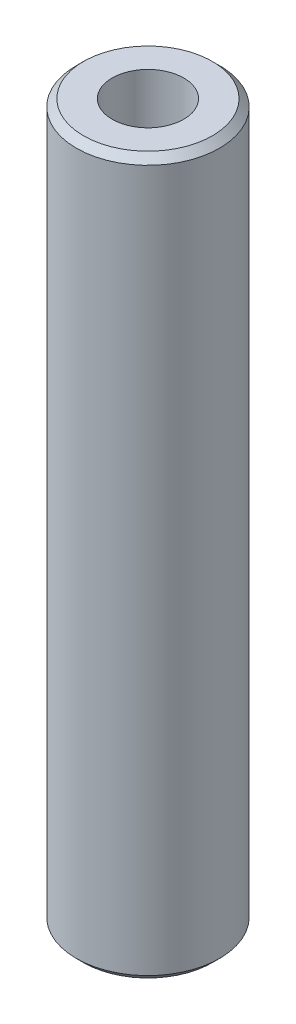
ISO-10303-21;
HEADER;
FILE_DESCRIPTION(('STEP AP214'),'2;1');
FILE_NAME('part.step','',(''),(''),'','','');
FILE_SCHEMA(('AUTOMOTIVE_DESIGN { 1 0 10303 214 1 1 1 1 }'));
ENDSEC;
DATA;
#1=APPLICATION_CONTEXT('core data for automotive mechanical design processes');
#2=APPLICATION_PROTOCOL_DEFINITION('international standard','automotive_design',2000,#1);
#3=PRODUCT_CONTEXT('',#1,'mechanical');
#4=PRODUCT('Part','Part','',(#3));
#5=PRODUCT_RELATED_PRODUCT_CATEGORY('part','',(#4));
#6=PRODUCT_DEFINITION_FORMATION('','',#4);
#7=PRODUCT_DEFINITION_CONTEXT('part definition',#1,'design');
#8=PRODUCT_DEFINITION('design','',#6,#7);
#9=PRODUCT_DEFINITION_SHAPE('','',#8);
#10=(LENGTH_UNIT() NAMED_UNIT(*) SI_UNIT(.MILLI.,.METRE.));
#11=(NAMED_UNIT(*) PLANE_ANGLE_UNIT() SI_UNIT($,.RADIAN.));
#12=(NAMED_UNIT(*) SI_UNIT($,.STERADIAN.) SOLID_ANGLE_UNIT());
#13=UNCERTAINTY_MEASURE_WITH_UNIT(LENGTH_MEASURE(1.E-05),#10,'distance_accuracy_value','');
#14=(GEOMETRIC_REPRESENTATION_CONTEXT(3) GLOBAL_UNCERTAINTY_ASSIGNED_CONTEXT((#13)) GLOBAL_UNIT_ASSIGNED_CONTEXT((#10,
#11,#12)) REPRESENTATION_CONTEXT('',''));
#15=CARTESIAN_POINT('',(0.,0.,0.));
#16=DIRECTION('',(0.,0.,1.));
#17=DIRECTION('',(1.,0.,0.));
#18=AXIS2_PLACEMENT_3D('',#15,#16,#17);
#19=CARTESIAN_POINT('',(0.,100.,0.));
#20=DIRECTION('',(0.,-1.,0.));
#21=DIRECTION('',(0.,0.,-1.));
#22=AXIS2_PLACEMENT_3D('',#19,#20,#21);
#23=CYLINDRICAL_SURFACE('',#22,10.);
#24=CARTESIAN_POINT('',(0.,99.,0.));
#25=DIRECTION('',(0.,1.,0.));
#26=DIRECTION('',(0.,0.,1.));
#27=AXIS2_PLACEMENT_3D('',#24,#25,#26);
#28=CIRCLE('',#27,10.);
#29=CARTESIAN_POINT('',(0.,99.,10.));
#30=VERTEX_POINT('',#29);
#31=EDGE_CURVE('E50',#30,#30,#28,.F.);
#32=ORIENTED_EDGE('',*,*,#31,.T.);
#33=EDGE_LOOP('',(#32));
#34=FACE_BOUND('',#33,.T.);
#35=CARTESIAN_POINT('',(0.,1.00000000000001,0.));
#36=DIRECTION('',(0.,1.,0.));
#37=DIRECTION('',(0.,0.,1.));
#38=AXIS2_PLACEMENT_3D('',#35,#36,#37);
#39=CIRCLE('',#38,10.);
#40=CARTESIAN_POINT('',(0.,1.00000000000001,10.));
#41=VERTEX_POINT('',#40);
#42=EDGE_CURVE('E51',#41,#41,#39,.T.);
#43=ORIENTED_EDGE('',*,*,#42,.T.);
#44=EDGE_LOOP('',(#43));
#45=FACE_BOUND('',#44,.T.);
#46=ADVANCED_FACE('F39',(#34,#45),#23,.T.);
#47=CARTESIAN_POINT('',(0.,100.,0.));
#48=DIRECTION('',(0.,1.,0.));
#49=DIRECTION('',(0.,0.,1.));
#50=AXIS2_PLACEMENT_3D('',#47,#48,#49);
#51=PLANE('',#50);
#52=CARTESIAN_POINT('',(0.,100.,0.));
#53=DIRECTION('',(0.,1.,0.));
#54=DIRECTION('',(0.,0.,1.));
#55=AXIS2_PLACEMENT_3D('',#52,#53,#54);
#56=CIRCLE('',#55,8.99999999999998);
#57=CARTESIAN_POINT('',(0.,100.,8.99999999999998));
#58=VERTEX_POINT('',#57);
#59=EDGE_CURVE('E54',#58,#58,#56,.T.);
#60=ORIENTED_EDGE('',*,*,#59,.T.);
#61=EDGE_LOOP('',(#60));
#62=FACE_BOUND('',#61,.T.);
#63=CARTESIAN_POINT('',(0.,100.,0.));
#64=DIRECTION('',(0.,1.,0.));
#65=DIRECTION('',(0.,0.,1.));
#66=AXIS2_PLACEMENT_3D('',#63,#64,#65);
#67=CIRCLE('',#66,5.);
#68=CARTESIAN_POINT('',(0.,100.,5.));
#69=VERTEX_POINT('',#68);
#70=EDGE_CURVE('E58',#69,#69,#67,.T.);
#71=ORIENTED_EDGE('',*,*,#70,.F.);
#72=EDGE_LOOP('',(#71));
#73=FACE_BOUND('',#72,.T.);
#74=ADVANCED_FACE('F66',(#62,#73),#51,.T.);
#75=CARTESIAN_POINT('',(0.,0.,0.));
#76=DIRECTION('',(0.,1.,0.));
#77=DIRECTION('',(0.,0.,1.));
#78=AXIS2_PLACEMENT_3D('',#75,#76,#77);
#79=PLANE('',#78);
#80=CARTESIAN_POINT('',(0.,0.,0.));
#81=DIRECTION('',(0.,1.,0.));
#82=DIRECTION('',(0.,0.,1.));
#83=AXIS2_PLACEMENT_3D('',#80,#81,#82);
#84=CIRCLE('',#83,8.99999999999999);
#85=CARTESIAN_POINT('',(0.,0.,8.99999999999999));
#86=VERTEX_POINT('',#85);
#87=EDGE_CURVE('E10',#86,#86,#84,.F.);
#88=ORIENTED_EDGE('',*,*,#87,.T.);
#89=EDGE_LOOP('',(#88));
#90=FACE_BOUND('',#89,.T.);
#91=CARTESIAN_POINT('',(0.,0.,0.));
#92=DIRECTION('',(0.,1.,0.));
#93=DIRECTION('',(0.,0.,1.));
#94=AXIS2_PLACEMENT_3D('',#91,#92,#93);
#95=CIRCLE('',#94,5.);
#96=CARTESIAN_POINT('',(0.,0.,5.));
#97=VERTEX_POINT('',#96);
#98=EDGE_CURVE('E62',#97,#97,#95,.T.);
#99=ORIENTED_EDGE('',*,*,#98,.T.);
#100=EDGE_LOOP('',(#99));
#101=FACE_BOUND('',#100,.T.);
#102=ADVANCED_FACE('F75',(#90,#101),#79,.F.);
#103=CARTESIAN_POINT('',(0.,100.,0.));
#104=DIRECTION('',(0.,-1.,0.));
#105=DIRECTION('',(0.,0.,-1.));
#106=AXIS2_PLACEMENT_3D('',#103,#104,#105);
#107=CYLINDRICAL_SURFACE('',#106,5.);
#108=ORIENTED_EDGE('',*,*,#70,.T.);
#109=EDGE_LOOP('',(#108));
#110=FACE_BOUND('',#109,.T.);
#111=ORIENTED_EDGE('',*,*,#98,.F.);
#112=EDGE_LOOP('',(#111));
#113=FACE_BOUND('',#112,.T.);
#114=ADVANCED_FACE('F69',(#110,#113),#107,.F.);
#115=CARTESIAN_POINT('',(0.,100.,0.));
#116=DIRECTION('',(0.,-1.,0.));
#117=DIRECTION('',(0.,0.,-1.));
#118=AXIS2_PLACEMENT_3D('',#115,#116,#117);
#119=CONICAL_SURFACE('',#118,8.99999999999998,0.785398163397444);
#120=ORIENTED_EDGE('',*,*,#31,.F.);
#121=EDGE_LOOP('',(#120));
#122=FACE_BOUND('',#121,.T.);
#123=ORIENTED_EDGE('',*,*,#59,.F.);
#124=EDGE_LOOP('',(#123));
#125=FACE_BOUND('',#124,.T.);
#126=ADVANCED_FACE('F82',(#122,#125),#119,.T.);
#127=CARTESIAN_POINT('',(0.,1.00000000000001,0.));
#128=DIRECTION('',(0.,1.,0.));
#129=DIRECTION('',(0.,0.,1.));
#130=AXIS2_PLACEMENT_3D('',#127,#128,#129);
#131=CONICAL_SURFACE('',#130,10.,0.785398163397444);
#132=ORIENTED_EDGE('',*,*,#87,.F.);
#133=EDGE_LOOP('',(#132));
#134=FACE_BOUND('',#133,.T.);
#135=ORIENTED_EDGE('',*,*,#42,.F.);
#136=EDGE_LOOP('',(#135));
#137=FACE_BOUND('',#136,.T.);
#138=ADVANCED_FACE('F45',(#134,#137),#131,.T.);
#139=CLOSED_SHELL('',(#46,#74,#102,#114,#126,#138));
#140=MANIFOLD_SOLID_BREP('B2',#139);
#141=ADVANCED_BREP_SHAPE_REPRESENTATION('',(#18,#140),#14);
#142=SHAPE_DEFINITION_REPRESENTATION(#9,#141);
ENDSEC;
END-ISO-10303-21;
